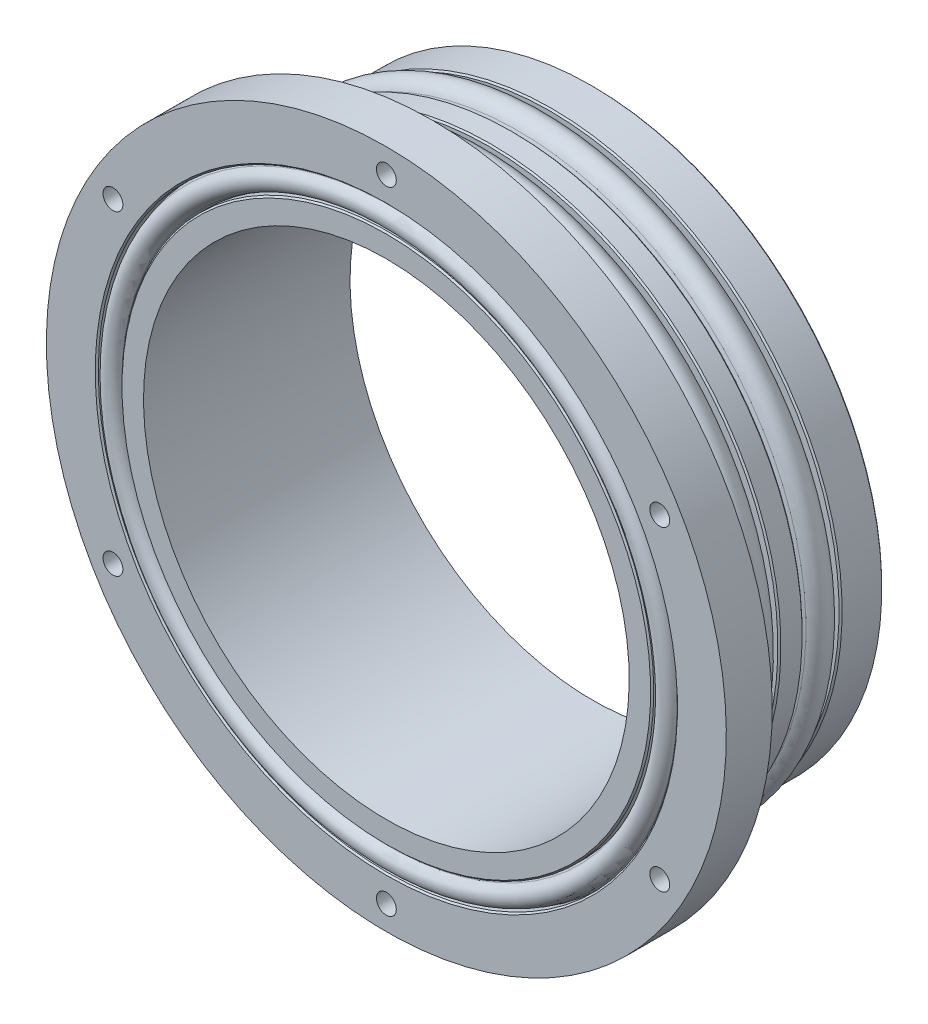
ISO-10303-21;
HEADER;
FILE_DESCRIPTION(('STEP AP214'),'2;1');
FILE_NAME('part.step','',(''),(''),'','','');
FILE_SCHEMA(('AUTOMOTIVE_DESIGN { 1 0 10303 214 1 1 1 1 }'));
ENDSEC;
DATA;
#1=APPLICATION_CONTEXT('core data for automotive mechanical design processes');
#2=APPLICATION_PROTOCOL_DEFINITION('international standard','automotive_design',2000,#1);
#3=PRODUCT_CONTEXT('',#1,'mechanical');
#4=PRODUCT('Part','Part','',(#3));
#5=PRODUCT_RELATED_PRODUCT_CATEGORY('part','',(#4));
#6=PRODUCT_DEFINITION_FORMATION('','',#4);
#7=PRODUCT_DEFINITION_CONTEXT('part definition',#1,'design');
#8=PRODUCT_DEFINITION('design','',#6,#7);
#9=PRODUCT_DEFINITION_SHAPE('','',#8);
#10=(LENGTH_UNIT() NAMED_UNIT(*) SI_UNIT(.MILLI.,.METRE.));
#11=(NAMED_UNIT(*) PLANE_ANGLE_UNIT() SI_UNIT($,.RADIAN.));
#12=(NAMED_UNIT(*) SI_UNIT($,.STERADIAN.) SOLID_ANGLE_UNIT());
#13=UNCERTAINTY_MEASURE_WITH_UNIT(LENGTH_MEASURE(1.E-05),#10,'distance_accuracy_value','');
#14=(GEOMETRIC_REPRESENTATION_CONTEXT(3) GLOBAL_UNCERTAINTY_ASSIGNED_CONTEXT((#13)) GLOBAL_UNIT_ASSIGNED_CONTEXT((#10,
#11,#12)) REPRESENTATION_CONTEXT('',''));
#15=CARTESIAN_POINT('',(0.,0.,0.));
#16=DIRECTION('',(0.,0.,1.));
#17=DIRECTION('',(1.,0.,0.));
#18=AXIS2_PLACEMENT_3D('',#15,#16,#17);
#19=CARTESIAN_POINT('',(0.,31.75,0.));
#20=DIRECTION('',(0.,0.,-1.));
#21=DIRECTION('',(0.,1.,0.));
#22=AXIS2_PLACEMENT_3D('',#19,#20,#21);
#23=PLANE('',#22);
#24=CARTESIAN_POINT('',(0.,-34.29,0.));
#25=DIRECTION('',(0.,0.,-1.));
#26=DIRECTION('',(0.,1.,0.));
#27=AXIS2_PLACEMENT_3D('',#24,#25,#26);
#28=CIRCLE('',#27,1.3);
#29=CARTESIAN_POINT('',(0.,-32.99,0.));
#30=VERTEX_POINT('',#29);
#31=EDGE_CURVE('E168',#30,#30,#28,.T.);
#32=ORIENTED_EDGE('',*,*,#31,.F.);
#33=EDGE_LOOP('',(#32));
#34=FACE_BOUND('',#33,.T.);
#35=CARTESIAN_POINT('',(-34.29,0.,0.));
#36=DIRECTION('',(0.,0.,-1.));
#37=DIRECTION('',(0.,1.,0.));
#38=AXIS2_PLACEMENT_3D('',#35,#36,#37);
#39=CIRCLE('',#38,1.3);
#40=CARTESIAN_POINT('',(-34.29,1.3,0.));
#41=VERTEX_POINT('',#40);
#42=EDGE_CURVE('E162',#41,#41,#39,.T.);
#43=ORIENTED_EDGE('',*,*,#42,.F.);
#44=EDGE_LOOP('',(#43));
#45=FACE_BOUND('',#44,.T.);
#46=CARTESIAN_POINT('',(0.,34.29,0.));
#47=DIRECTION('',(0.,0.,-1.));
#48=DIRECTION('',(0.,1.,0.));
#49=AXIS2_PLACEMENT_3D('',#46,#47,#48);
#50=CIRCLE('',#49,1.3);
#51=CARTESIAN_POINT('',(0.,35.59,0.));
#52=VERTEX_POINT('',#51);
#53=EDGE_CURVE('E156',#52,#52,#50,.T.);
#54=ORIENTED_EDGE('',*,*,#53,.F.);
#55=EDGE_LOOP('',(#54));
#56=FACE_BOUND('',#55,.T.);
#57=CARTESIAN_POINT('',(34.29,0.,0.));
#58=DIRECTION('',(0.,0.,-1.));
#59=DIRECTION('',(0.,1.,0.));
#60=AXIS2_PLACEMENT_3D('',#57,#58,#59);
#61=CIRCLE('',#60,1.3);
#62=CARTESIAN_POINT('',(34.29,1.3,0.));
#63=VERTEX_POINT('',#62);
#64=EDGE_CURVE('E150',#63,#63,#61,.T.);
#65=ORIENTED_EDGE('',*,*,#64,.F.);
#66=EDGE_LOOP('',(#65));
#67=FACE_BOUND('',#66,.T.);
#68=CARTESIAN_POINT('',(0.,0.,0.));
#69=DIRECTION('',(0.,0.,-1.));
#70=DIRECTION('',(0.,1.,0.));
#71=AXIS2_PLACEMENT_3D('',#68,#69,#70);
#72=CIRCLE('',#71,37.773);
#73=CARTESIAN_POINT('',(0.,37.773,0.));
#74=VERTEX_POINT('',#73);
#75=EDGE_CURVE('E83',#74,#74,#72,.T.);
#76=ORIENTED_EDGE('',*,*,#75,.T.);
#77=EDGE_LOOP('',(#76));
#78=FACE_BOUND('',#77,.T.);
#79=CARTESIAN_POINT('',(0.,0.,0.));
#80=DIRECTION('',(0.,0.,-1.));
#81=DIRECTION('',(0.,1.,0.));
#82=AXIS2_PLACEMENT_3D('',#79,#80,#81);
#83=CIRCLE('',#82,31.75);
#84=CARTESIAN_POINT('',(0.,31.75,0.));
#85=VERTEX_POINT('',#84);
#86=EDGE_CURVE('E110',#85,#85,#83,.T.);
#87=ORIENTED_EDGE('',*,*,#86,.F.);
#88=EDGE_LOOP('',(#87));
#89=FACE_BOUND('',#88,.T.);
#90=ADVANCED_FACE('F30',(#34,#45,#56,#67,#78,#89),#23,.T.);
#91=CARTESIAN_POINT('',(0.,0.,0.));
#92=DIRECTION('',(0.,0.,-1.));
#93=DIRECTION('',(0.,1.,0.));
#94=AXIS2_PLACEMENT_3D('',#91,#92,#93);
#95=CYLINDRICAL_SURFACE('',#94,37.973);
#96=CARTESIAN_POINT('',(0.,0.,0.199999999999959));
#97=DIRECTION('',(0.,0.,-1.));
#98=DIRECTION('',(0.,1.,0.));
#99=AXIS2_PLACEMENT_3D('',#96,#97,#98);
#100=CIRCLE('',#99,37.973);
#101=CARTESIAN_POINT('',(0.,37.973,0.199999999999964));
#102=VERTEX_POINT('',#101);
#103=EDGE_CURVE('E77',#102,#102,#100,.F.);
#104=ORIENTED_EDGE('',*,*,#103,.T.);
#105=EDGE_LOOP('',(#104));
#106=FACE_BOUND('',#105,.T.);
#107=CARTESIAN_POINT('',(0.,0.,5.38700000000003));
#108=DIRECTION('',(0.,0.,1.));
#109=DIRECTION('',(0.,-1.,0.));
#110=AXIS2_PLACEMENT_3D('',#107,#108,#109);
#111=CIRCLE('',#110,37.973);
#112=CARTESIAN_POINT('',(0.,-37.973,5.38700000000002));
#113=VERTEX_POINT('',#112);
#114=EDGE_CURVE('E80',#113,#113,#111,.F.);
#115=ORIENTED_EDGE('',*,*,#114,.T.);
#116=EDGE_LOOP('',(#115));
#117=FACE_BOUND('',#116,.T.);
#118=ADVANCED_FACE('F207',(#106,#117),#95,.T.);
#119=CARTESIAN_POINT('',(0.,35.2806,5.587));
#120=DIRECTION('',(0.,0.,1.));
#121=DIRECTION('',(0.,-1.,0.));
#122=AXIS2_PLACEMENT_3D('',#119,#120,#121);
#123=PLANE('',#122);
#124=CARTESIAN_POINT('',(0.,0.,5.587));
#125=DIRECTION('',(0.,0.,1.));
#126=DIRECTION('',(0.,-1.,0.));
#127=AXIS2_PLACEMENT_3D('',#124,#125,#126);
#128=CIRCLE('',#127,36.0426);
#129=CARTESIAN_POINT('',(0.,-36.0426,5.58699999999999));
#130=VERTEX_POINT('',#129);
#131=EDGE_CURVE('E10',#130,#130,#128,.T.);
#132=ORIENTED_EDGE('',*,*,#131,.F.);
#133=EDGE_LOOP('',(#132));
#134=FACE_BOUND('',#133,.T.);
#135=CARTESIAN_POINT('',(0.,0.,5.587));
#136=DIRECTION('',(0.,0.,1.));
#137=DIRECTION('',(0.,-1.,0.));
#138=AXIS2_PLACEMENT_3D('',#135,#136,#137);
#139=CIRCLE('',#138,37.773);
#140=CARTESIAN_POINT('',(0.,-37.773,5.58699999999999));
#141=VERTEX_POINT('',#140);
#142=EDGE_CURVE('E68',#141,#141,#139,.T.);
#143=ORIENTED_EDGE('',*,*,#142,.T.);
#144=EDGE_LOOP('',(#143));
#145=FACE_BOUND('',#144,.T.);
#146=ADVANCED_FACE('F213',(#134,#145),#123,.T.);
#147=CARTESIAN_POINT('',(0.,37.973,10.413));
#148=DIRECTION('',(0.,0.,-1.));
#149=DIRECTION('',(0.,1.,0.));
#150=AXIS2_PLACEMENT_3D('',#147,#148,#149);
#151=PLANE('',#150);
#152=CARTESIAN_POINT('',(0.,0.,10.413));
#153=DIRECTION('',(0.,0.,-1.));
#154=DIRECTION('',(0.,1.,0.));
#155=AXIS2_PLACEMENT_3D('',#152,#153,#154);
#156=CIRCLE('',#155,36.0426);
#157=CARTESIAN_POINT('',(0.,36.0426,10.413));
#158=VERTEX_POINT('',#157);
#159=EDGE_CURVE('E37',#158,#158,#156,.T.);
#160=ORIENTED_EDGE('',*,*,#159,.F.);
#161=EDGE_LOOP('',(#160));
#162=FACE_BOUND('',#161,.T.);
#163=CARTESIAN_POINT('',(0.,0.,10.413));
#164=DIRECTION('',(0.,0.,-1.));
#165=DIRECTION('',(0.,1.,0.));
#166=AXIS2_PLACEMENT_3D('',#163,#164,#165);
#167=CIRCLE('',#166,37.773);
#168=CARTESIAN_POINT('',(0.,37.773,10.413));
#169=VERTEX_POINT('',#168);
#170=EDGE_CURVE('E65',#169,#169,#167,.T.);
#171=ORIENTED_EDGE('',*,*,#170,.T.);
#172=EDGE_LOOP('',(#171));
#173=FACE_BOUND('',#172,.T.);
#174=ADVANCED_FACE('F252',(#162,#173),#151,.T.);
#175=CARTESIAN_POINT('',(0.,0.,0.));
#176=DIRECTION('',(0.,0.,-1.));
#177=DIRECTION('',(0.,1.,0.));
#178=AXIS2_PLACEMENT_3D('',#175,#176,#177);
#179=CYLINDRICAL_SURFACE('',#178,37.973);
#180=CARTESIAN_POINT('',(0.,0.,10.613));
#181=DIRECTION('',(0.,0.,-1.));
#182=DIRECTION('',(0.,1.,0.));
#183=AXIS2_PLACEMENT_3D('',#180,#181,#182);
#184=CIRCLE('',#183,37.973);
#185=CARTESIAN_POINT('',(0.,37.973,10.613));
#186=VERTEX_POINT('',#185);
#187=EDGE_CURVE('E59',#186,#186,#184,.F.);
#188=ORIENTED_EDGE('',*,*,#187,.T.);
#189=EDGE_LOOP('',(#188));
#190=FACE_BOUND('',#189,.T.);
#191=CARTESIAN_POINT('',(0.,0.,13.387));
#192=DIRECTION('',(0.,0.,1.));
#193=DIRECTION('',(0.,-1.,0.));
#194=AXIS2_PLACEMENT_3D('',#191,#192,#193);
#195=CIRCLE('',#194,37.973);
#196=CARTESIAN_POINT('',(0.,-37.973,13.387));
#197=VERTEX_POINT('',#196);
#198=EDGE_CURVE('E62',#197,#197,#195,.F.);
#199=ORIENTED_EDGE('',*,*,#198,.T.);
#200=EDGE_LOOP('',(#199));
#201=FACE_BOUND('',#200,.T.);
#202=ADVANCED_FACE('F254',(#190,#201),#179,.T.);
#203=CARTESIAN_POINT('',(0.,35.2806,13.587));
#204=DIRECTION('',(0.,0.,1.));
#205=DIRECTION('',(0.,-1.,0.));
#206=AXIS2_PLACEMENT_3D('',#203,#204,#205);
#207=PLANE('',#206);
#208=CARTESIAN_POINT('',(0.,0.,13.587));
#209=DIRECTION('',(0.,0.,1.));
#210=DIRECTION('',(0.,-1.,0.));
#211=AXIS2_PLACEMENT_3D('',#208,#209,#210);
#212=CIRCLE('',#211,36.0426);
#213=CARTESIAN_POINT('',(0.,-36.0426,13.587));
#214=VERTEX_POINT('',#213);
#215=EDGE_CURVE('E50',#214,#214,#212,.T.);
#216=ORIENTED_EDGE('',*,*,#215,.F.);
#217=EDGE_LOOP('',(#216));
#218=FACE_BOUND('',#217,.T.);
#219=CARTESIAN_POINT('',(0.,0.,13.587));
#220=DIRECTION('',(0.,0.,1.));
#221=DIRECTION('',(0.,-1.,0.));
#222=AXIS2_PLACEMENT_3D('',#219,#220,#221);
#223=CIRCLE('',#222,37.773);
#224=CARTESIAN_POINT('',(0.,-37.773,13.587));
#225=VERTEX_POINT('',#224);
#226=EDGE_CURVE('E56',#225,#225,#223,.T.);
#227=ORIENTED_EDGE('',*,*,#226,.T.);
#228=EDGE_LOOP('',(#227));
#229=FACE_BOUND('',#228,.T.);
#230=ADVANCED_FACE('F261',(#218,#229),#207,.T.);
#231=CARTESIAN_POINT('',(0.,37.973,18.413));
#232=DIRECTION('',(0.,0.,-1.));
#233=DIRECTION('',(0.,1.,0.));
#234=AXIS2_PLACEMENT_3D('',#231,#232,#233);
#235=PLANE('',#234);
#236=CARTESIAN_POINT('',(0.,0.,18.413));
#237=DIRECTION('',(0.,0.,-1.));
#238=DIRECTION('',(0.,1.,0.));
#239=AXIS2_PLACEMENT_3D('',#236,#237,#238);
#240=CIRCLE('',#239,36.0426);
#241=CARTESIAN_POINT('',(0.,36.0426,18.413));
#242=VERTEX_POINT('',#241);
#243=EDGE_CURVE('E53',#242,#242,#240,.T.);
#244=ORIENTED_EDGE('',*,*,#243,.F.);
#245=EDGE_LOOP('',(#244));
#246=FACE_BOUND('',#245,.T.);
#247=CARTESIAN_POINT('',(0.,0.,18.413));
#248=DIRECTION('',(0.,0.,-1.));
#249=DIRECTION('',(0.,1.,0.));
#250=AXIS2_PLACEMENT_3D('',#247,#248,#249);
#251=CIRCLE('',#250,37.773);
#252=CARTESIAN_POINT('',(0.,37.773,18.413));
#253=VERTEX_POINT('',#252);
#254=EDGE_CURVE('E74',#253,#253,#251,.T.);
#255=ORIENTED_EDGE('',*,*,#254,.T.);
#256=EDGE_LOOP('',(#255));
#257=FACE_BOUND('',#256,.T.);
#258=ADVANCED_FACE('F268',(#246,#257),#235,.T.);
#259=CARTESIAN_POINT('',(0.,0.,0.));
#260=DIRECTION('',(0.,0.,-1.));
#261=DIRECTION('',(0.,1.,0.));
#262=AXIS2_PLACEMENT_3D('',#259,#260,#261);
#263=CYLINDRICAL_SURFACE('',#262,37.973);
#264=CARTESIAN_POINT('',(0.,0.,18.613));
#265=DIRECTION('',(0.,0.,-1.));
#266=DIRECTION('',(0.,1.,0.));
#267=AXIS2_PLACEMENT_3D('',#264,#265,#266);
#268=CIRCLE('',#267,37.973);
#269=CARTESIAN_POINT('',(0.,37.973,18.613));
#270=VERTEX_POINT('',#269);
#271=EDGE_CURVE('E71',#270,#270,#268,.F.);
#272=ORIENTED_EDGE('',*,*,#271,.T.);
#273=EDGE_LOOP('',(#272));
#274=FACE_BOUND('',#273,.T.);
#275=CARTESIAN_POINT('',(0.,0.,21.));
#276=DIRECTION('',(0.,0.,-1.));
#277=DIRECTION('',(0.,1.,0.));
#278=AXIS2_PLACEMENT_3D('',#275,#276,#277);
#279=CIRCLE('',#278,37.973);
#280=CARTESIAN_POINT('',(0.,37.973,21.));
#281=VERTEX_POINT('',#280);
#282=EDGE_CURVE('E98',#281,#281,#279,.T.);
#283=ORIENTED_EDGE('',*,*,#282,.T.);
#284=EDGE_LOOP('',(#283));
#285=FACE_BOUND('',#284,.T.);
#286=ADVANCED_FACE('F272',(#274,#285),#263,.T.);
#287=CARTESIAN_POINT('',(0.,37.973,21.));
#288=DIRECTION('',(0.,0.,-1.));
#289=DIRECTION('',(0.,1.,0.));
#290=AXIS2_PLACEMENT_3D('',#287,#288,#289);
#291=PLANE('',#290);
#292=CARTESIAN_POINT('',(-35.7451985412027,20.6375,21.));
#293=DIRECTION('',(0.,0.,-1.));
#294=DIRECTION('',(0.,1.,0.));
#295=AXIS2_PLACEMENT_3D('',#292,#293,#294);
#296=CIRCLE('',#295,1.3);
#297=CARTESIAN_POINT('',(-35.7451985412027,21.9375,21.));
#298=VERTEX_POINT('',#297);
#299=EDGE_CURVE('E143',#298,#298,#296,.F.);
#300=ORIENTED_EDGE('',*,*,#299,.T.);
#301=EDGE_LOOP('',(#300));
#302=FACE_BOUND('',#301,.T.);
#303=CARTESIAN_POINT('',(-35.7451985412027,-20.6375,21.));
#304=DIRECTION('',(0.,0.,-1.));
#305=DIRECTION('',(0.,1.,0.));
#306=AXIS2_PLACEMENT_3D('',#303,#304,#305);
#307=CIRCLE('',#306,1.3);
#308=CARTESIAN_POINT('',(-35.7451985412027,-19.3375,21.));
#309=VERTEX_POINT('',#308);
#310=EDGE_CURVE('E137',#309,#309,#307,.F.);
#311=ORIENTED_EDGE('',*,*,#310,.T.);
#312=EDGE_LOOP('',(#311));
#313=FACE_BOUND('',#312,.T.);
#314=CARTESIAN_POINT('',(0.,-41.275,21.));
#315=DIRECTION('',(0.,0.,-1.));
#316=DIRECTION('',(0.,1.,0.));
#317=AXIS2_PLACEMENT_3D('',#314,#315,#316);
#318=CIRCLE('',#317,1.3);
#319=CARTESIAN_POINT('',(0.,-39.975,21.));
#320=VERTEX_POINT('',#319);
#321=EDGE_CURVE('E131',#320,#320,#318,.F.);
#322=ORIENTED_EDGE('',*,*,#321,.T.);
#323=EDGE_LOOP('',(#322));
#324=FACE_BOUND('',#323,.T.);
#325=CARTESIAN_POINT('',(35.7451985412027,-20.6375,21.));
#326=DIRECTION('',(0.,0.,-1.));
#327=DIRECTION('',(0.,1.,0.));
#328=AXIS2_PLACEMENT_3D('',#325,#326,#327);
#329=CIRCLE('',#328,1.3);
#330=CARTESIAN_POINT('',(35.7451985412027,-19.3375,21.));
#331=VERTEX_POINT('',#330);
#332=EDGE_CURVE('E125',#331,#331,#329,.F.);
#333=ORIENTED_EDGE('',*,*,#332,.T.);
#334=EDGE_LOOP('',(#333));
#335=FACE_BOUND('',#334,.T.);
#336=CARTESIAN_POINT('',(35.7451985412027,20.6375,21.));
#337=DIRECTION('',(0.,0.,-1.));
#338=DIRECTION('',(0.,1.,0.));
#339=AXIS2_PLACEMENT_3D('',#336,#337,#338);
#340=CIRCLE('',#339,1.3);
#341=CARTESIAN_POINT('',(35.7451985412027,21.9375,21.));
#342=VERTEX_POINT('',#341);
#343=EDGE_CURVE('E119',#342,#342,#340,.F.);
#344=ORIENTED_EDGE('',*,*,#343,.T.);
#345=EDGE_LOOP('',(#344));
#346=FACE_BOUND('',#345,.T.);
#347=CARTESIAN_POINT('',(0.,41.275,21.));
#348=DIRECTION('',(0.,0.,-1.));
#349=DIRECTION('',(0.,1.,0.));
#350=AXIS2_PLACEMENT_3D('',#347,#348,#349);
#351=CIRCLE('',#350,1.3);
#352=CARTESIAN_POINT('',(0.,42.575,21.));
#353=VERTEX_POINT('',#352);
#354=EDGE_CURVE('E113',#353,#353,#351,.F.);
#355=ORIENTED_EDGE('',*,*,#354,.T.);
#356=EDGE_LOOP('',(#355));
#357=FACE_BOUND('',#356,.T.);
#358=CARTESIAN_POINT('',(0.,0.,21.));
#359=DIRECTION('',(0.,0.,-1.));
#360=DIRECTION('',(0.,1.,0.));
#361=AXIS2_PLACEMENT_3D('',#358,#359,#360);
#362=CIRCLE('',#361,44.45);
#363=CARTESIAN_POINT('',(0.,44.45,21.));
#364=VERTEX_POINT('',#363);
#365=EDGE_CURVE('E101',#364,#364,#362,.T.);
#366=ORIENTED_EDGE('',*,*,#365,.T.);
#367=EDGE_LOOP('',(#366));
#368=FACE_BOUND('',#367,.T.);
#369=ORIENTED_EDGE('',*,*,#282,.F.);
#370=EDGE_LOOP('',(#369));
#371=FACE_BOUND('',#370,.T.);
#372=ADVANCED_FACE('F276',(#302,#313,#324,#335,#346,#357,#368,#371),#291,.T.);
#373=CARTESIAN_POINT('',(0.,0.,0.));
#374=DIRECTION('',(0.,0.,-1.));
#375=DIRECTION('',(0.,1.,0.));
#376=AXIS2_PLACEMENT_3D('',#373,#374,#375);
#377=CYLINDRICAL_SURFACE('',#376,44.45);
#378=CARTESIAN_POINT('',(0.,0.,27.));
#379=DIRECTION('',(0.,0.,-1.));
#380=DIRECTION('',(0.,1.,0.));
#381=AXIS2_PLACEMENT_3D('',#378,#379,#380);
#382=CIRCLE('',#381,44.45);
#383=CARTESIAN_POINT('',(0.,44.45,27.));
#384=VERTEX_POINT('',#383);
#385=EDGE_CURVE('E104',#384,#384,#382,.T.);
#386=ORIENTED_EDGE('',*,*,#385,.T.);
#387=EDGE_LOOP('',(#386));
#388=FACE_BOUND('',#387,.T.);
#389=ORIENTED_EDGE('',*,*,#365,.F.);
#390=EDGE_LOOP('',(#389));
#391=FACE_BOUND('',#390,.T.);
#392=ADVANCED_FACE('F280',(#388,#391),#377,.T.);
#393=CARTESIAN_POINT('',(0.,44.45,27.));
#394=DIRECTION('',(0.,0.,1.));
#395=DIRECTION('',(0.,-1.,0.));
#396=AXIS2_PLACEMENT_3D('',#393,#394,#395);
#397=PLANE('',#396);
#398=CARTESIAN_POINT('',(0.,0.,27.));
#399=DIRECTION('',(0.,0.,1.));
#400=DIRECTION('',(0.,-1.,0.));
#401=AXIS2_PLACEMENT_3D('',#398,#399,#400);
#402=CIRCLE('',#401,38.0587);
#403=CARTESIAN_POINT('',(0.,-38.0587,27.));
#404=VERTEX_POINT('',#403);
#405=EDGE_CURVE('E95',#404,#404,#402,.F.);
#406=ORIENTED_EDGE('',*,*,#405,.T.);
#407=EDGE_LOOP('',(#406));
#408=FACE_BOUND('',#407,.T.);
#409=CARTESIAN_POINT('',(-35.7451985412027,20.6375,27.));
#410=DIRECTION('',(0.,0.,1.));
#411=DIRECTION('',(1.,0.,0.));
#412=AXIS2_PLACEMENT_3D('',#409,#410,#411);
#413=CIRCLE('',#412,1.3);
#414=CARTESIAN_POINT('',(-34.4451985412027,20.6375,27.));
#415=VERTEX_POINT('',#414);
#416=EDGE_CURVE('E146',#415,#415,#413,.T.);
#417=ORIENTED_EDGE('',*,*,#416,.F.);
#418=EDGE_LOOP('',(#417));
#419=FACE_BOUND('',#418,.T.);
#420=CARTESIAN_POINT('',(-35.7451985412027,-20.6375,27.));
#421=DIRECTION('',(0.,0.,1.));
#422=DIRECTION('',(1.,0.,0.));
#423=AXIS2_PLACEMENT_3D('',#420,#421,#422);
#424=CIRCLE('',#423,1.3);
#425=CARTESIAN_POINT('',(-34.4451985412027,-20.6375,27.));
#426=VERTEX_POINT('',#425);
#427=EDGE_CURVE('E140',#426,#426,#424,.T.);
#428=ORIENTED_EDGE('',*,*,#427,.F.);
#429=EDGE_LOOP('',(#428));
#430=FACE_BOUND('',#429,.T.);
#431=CARTESIAN_POINT('',(0.,-41.275,27.));
#432=DIRECTION('',(0.,0.,1.));
#433=DIRECTION('',(1.,0.,0.));
#434=AXIS2_PLACEMENT_3D('',#431,#432,#433);
#435=CIRCLE('',#434,1.3);
#436=CARTESIAN_POINT('',(1.30000000000001,-41.275,27.));
#437=VERTEX_POINT('',#436);
#438=EDGE_CURVE('E134',#437,#437,#435,.T.);
#439=ORIENTED_EDGE('',*,*,#438,.F.);
#440=EDGE_LOOP('',(#439));
#441=FACE_BOUND('',#440,.T.);
#442=CARTESIAN_POINT('',(35.7451985412027,-20.6375,27.));
#443=DIRECTION('',(0.,0.,1.));
#444=DIRECTION('',(1.,0.,0.));
#445=AXIS2_PLACEMENT_3D('',#442,#443,#444);
#446=CIRCLE('',#445,1.3);
#447=CARTESIAN_POINT('',(37.0451985412027,-20.6375,27.));
#448=VERTEX_POINT('',#447);
#449=EDGE_CURVE('E128',#448,#448,#446,.T.);
#450=ORIENTED_EDGE('',*,*,#449,.F.);
#451=EDGE_LOOP('',(#450));
#452=FACE_BOUND('',#451,.T.);
#453=CARTESIAN_POINT('',(35.7451985412027,20.6375,27.));
#454=DIRECTION('',(0.,0.,1.));
#455=DIRECTION('',(1.,0.,0.));
#456=AXIS2_PLACEMENT_3D('',#453,#454,#455);
#457=CIRCLE('',#456,1.3);
#458=CARTESIAN_POINT('',(37.0451985412027,20.6375,27.));
#459=VERTEX_POINT('',#458);
#460=EDGE_CURVE('E122',#459,#459,#457,.T.);
#461=ORIENTED_EDGE('',*,*,#460,.F.);
#462=EDGE_LOOP('',(#461));
#463=FACE_BOUND('',#462,.T.);
#464=CARTESIAN_POINT('',(0.,41.275,27.));
#465=DIRECTION('',(0.,0.,1.));
#466=DIRECTION('',(1.,0.,0.));
#467=AXIS2_PLACEMENT_3D('',#464,#465,#466);
#468=CIRCLE('',#467,1.3);
#469=CARTESIAN_POINT('',(1.3,41.275,27.));
#470=VERTEX_POINT('',#469);
#471=EDGE_CURVE('E116',#470,#470,#468,.T.);
#472=ORIENTED_EDGE('',*,*,#471,.F.);
#473=EDGE_LOOP('',(#472));
#474=FACE_BOUND('',#473,.T.);
#475=ORIENTED_EDGE('',*,*,#385,.F.);
#476=EDGE_LOOP('',(#475));
#477=FACE_BOUND('',#476,.T.);
#478=ADVANCED_FACE('F284',(#408,#419,#430,#441,#452,#463,#474,#477),#397,.T.);
#479=CARTESIAN_POINT('',(0.,0.,0.));
#480=DIRECTION('',(0.,0.,-1.));
#481=DIRECTION('',(0.,1.,0.));
#482=AXIS2_PLACEMENT_3D('',#479,#480,#481);
#483=CYLINDRICAL_SURFACE('',#482,37.8587);
#484=CARTESIAN_POINT('',(0.,0.,25.8061578635827));
#485=DIRECTION('',(0.,0.,-1.));
#486=DIRECTION('',(-1.,0.,0.));
#487=AXIS2_PLACEMENT_3D('',#484,#485,#486);
#488=CIRCLE('',#487,37.8587);
#489=CARTESIAN_POINT('',(-37.8587,0.,25.8061578635827));
#490=VERTEX_POINT('',#489);
#491=EDGE_CURVE('E41',#490,#490,#488,.F.);
#492=ORIENTED_EDGE('',*,*,#491,.F.);
#493=EDGE_LOOP('',(#492));
#494=FACE_BOUND('',#493,.T.);
#495=CARTESIAN_POINT('',(0.,0.,26.8));
#496=DIRECTION('',(0.,0.,1.));
#497=DIRECTION('',(0.,-1.,0.));
#498=AXIS2_PLACEMENT_3D('',#495,#496,#497);
#499=CIRCLE('',#498,37.8587);
#500=CARTESIAN_POINT('',(0.,-37.8587,26.8));
#501=VERTEX_POINT('',#500);
#502=EDGE_CURVE('E92',#501,#501,#499,.T.);
#503=ORIENTED_EDGE('',*,*,#502,.T.);
#504=EDGE_LOOP('',(#503));
#505=FACE_BOUND('',#504,.T.);
#506=ADVANCED_FACE('F288',(#494,#505),#483,.F.);
#507=CARTESIAN_POINT('',(0.,0.,0.));
#508=DIRECTION('',(0.,0.,-1.));
#509=DIRECTION('',(0.,1.,0.));
#510=AXIS2_PLACEMENT_3D('',#507,#508,#509);
#511=CYLINDRICAL_SURFACE('',#510,34.7599);
#512=CARTESIAN_POINT('',(0.,0.,25.821791671619));
#513=DIRECTION('',(0.,0.,1.));
#514=DIRECTION('',(1.,0.,0.));
#515=AXIS2_PLACEMENT_3D('',#512,#513,#514);
#516=CIRCLE('',#515,34.7599);
#517=CARTESIAN_POINT('',(34.7599,0.,25.821791671619));
#518=VERTEX_POINT('',#517);
#519=EDGE_CURVE('E45',#518,#518,#516,.F.);
#520=ORIENTED_EDGE('',*,*,#519,.F.);
#521=EDGE_LOOP('',(#520));
#522=FACE_BOUND('',#521,.T.);
#523=CARTESIAN_POINT('',(0.,0.,26.8));
#524=DIRECTION('',(0.,0.,1.));
#525=DIRECTION('',(0.,-1.,0.));
#526=AXIS2_PLACEMENT_3D('',#523,#524,#525);
#527=CIRCLE('',#526,34.7599);
#528=CARTESIAN_POINT('',(0.,-34.7599,26.8));
#529=VERTEX_POINT('',#528);
#530=EDGE_CURVE('E89',#529,#529,#527,.F.);
#531=ORIENTED_EDGE('',*,*,#530,.T.);
#532=EDGE_LOOP('',(#531));
#533=FACE_BOUND('',#532,.T.);
#534=ADVANCED_FACE('F292',(#522,#533),#511,.T.);
#535=CARTESIAN_POINT('',(0.,34.7599,27.));
#536=DIRECTION('',(0.,0.,1.));
#537=DIRECTION('',(0.,-1.,0.));
#538=AXIS2_PLACEMENT_3D('',#535,#536,#537);
#539=PLANE('',#538);
#540=CARTESIAN_POINT('',(0.,0.,27.));
#541=DIRECTION('',(0.,0.,1.));
#542=DIRECTION('',(0.,-1.,0.));
#543=AXIS2_PLACEMENT_3D('',#540,#541,#542);
#544=CIRCLE('',#543,34.5599);
#545=CARTESIAN_POINT('',(0.,-34.5599,27.));
#546=VERTEX_POINT('',#545);
#547=EDGE_CURVE('E86',#546,#546,#544,.T.);
#548=ORIENTED_EDGE('',*,*,#547,.T.);
#549=EDGE_LOOP('',(#548));
#550=FACE_BOUND('',#549,.T.);
#551=CARTESIAN_POINT('',(0.,0.,27.));
#552=DIRECTION('',(0.,0.,-1.));
#553=DIRECTION('',(0.,1.,0.));
#554=AXIS2_PLACEMENT_3D('',#551,#552,#553);
#555=CIRCLE('',#554,31.75);
#556=CARTESIAN_POINT('',(0.,31.75,27.));
#557=VERTEX_POINT('',#556);
#558=EDGE_CURVE('E107',#557,#557,#555,.T.);
#559=ORIENTED_EDGE('',*,*,#558,.T.);
#560=EDGE_LOOP('',(#559));
#561=FACE_BOUND('',#560,.T.);
#562=ADVANCED_FACE('F296',(#550,#561),#539,.T.);
#563=CARTESIAN_POINT('',(0.,0.,0.));
#564=DIRECTION('',(0.,0.,-1.));
#565=DIRECTION('',(0.,1.,0.));
#566=AXIS2_PLACEMENT_3D('',#563,#564,#565);
#567=CYLINDRICAL_SURFACE('',#566,31.75);
#568=ORIENTED_EDGE('',*,*,#86,.T.);
#569=EDGE_LOOP('',(#568));
#570=FACE_BOUND('',#569,.T.);
#571=ORIENTED_EDGE('',*,*,#558,.F.);
#572=EDGE_LOOP('',(#571));
#573=FACE_BOUND('',#572,.T.);
#574=ADVANCED_FACE('F300',(#570,#573),#567,.F.);
#575=CARTESIAN_POINT('',(0.,41.275,17.3230447378299));
#576=DIRECTION('',(0.,0.,1.));
#577=DIRECTION('',(1.,0.,0.));
#578=AXIS2_PLACEMENT_3D('',#575,#576,#577);
#579=CYLINDRICAL_SURFACE('',#578,1.3);
#580=ORIENTED_EDGE('',*,*,#471,.T.);
#581=EDGE_LOOP('',(#580));
#582=FACE_BOUND('',#581,.T.);
#583=ORIENTED_EDGE('',*,*,#354,.F.);
#584=EDGE_LOOP('',(#583));
#585=FACE_BOUND('',#584,.T.);
#586=ADVANCED_FACE('F304',(#582,#585),#579,.F.);
#587=CARTESIAN_POINT('',(35.7451985412027,20.6375,17.3230447378299));
#588=DIRECTION('',(0.,0.,1.));
#589=DIRECTION('',(1.,0.,0.));
#590=AXIS2_PLACEMENT_3D('',#587,#588,#589);
#591=CYLINDRICAL_SURFACE('',#590,1.3);
#592=ORIENTED_EDGE('',*,*,#460,.T.);
#593=EDGE_LOOP('',(#592));
#594=FACE_BOUND('',#593,.T.);
#595=ORIENTED_EDGE('',*,*,#343,.F.);
#596=EDGE_LOOP('',(#595));
#597=FACE_BOUND('',#596,.T.);
#598=ADVANCED_FACE('F308',(#594,#597),#591,.F.);
#599=CARTESIAN_POINT('',(35.7451985412027,-20.6375,17.3230447378299));
#600=DIRECTION('',(0.,0.,1.));
#601=DIRECTION('',(1.,0.,0.));
#602=AXIS2_PLACEMENT_3D('',#599,#600,#601);
#603=CYLINDRICAL_SURFACE('',#602,1.3);
#604=ORIENTED_EDGE('',*,*,#449,.T.);
#605=EDGE_LOOP('',(#604));
#606=FACE_BOUND('',#605,.T.);
#607=ORIENTED_EDGE('',*,*,#332,.F.);
#608=EDGE_LOOP('',(#607));
#609=FACE_BOUND('',#608,.T.);
#610=ADVANCED_FACE('F312',(#606,#609),#603,.F.);
#611=CARTESIAN_POINT('',(0.,-41.275,17.3230447378299));
#612=DIRECTION('',(0.,0.,1.));
#613=DIRECTION('',(1.,0.,0.));
#614=AXIS2_PLACEMENT_3D('',#611,#612,#613);
#615=CYLINDRICAL_SURFACE('',#614,1.3);
#616=ORIENTED_EDGE('',*,*,#438,.T.);
#617=EDGE_LOOP('',(#616));
#618=FACE_BOUND('',#617,.T.);
#619=ORIENTED_EDGE('',*,*,#321,.F.);
#620=EDGE_LOOP('',(#619));
#621=FACE_BOUND('',#620,.T.);
#622=ADVANCED_FACE('F316',(#618,#621),#615,.F.);
#623=CARTESIAN_POINT('',(-35.7451985412027,-20.6375,17.3230447378299));
#624=DIRECTION('',(0.,0.,1.));
#625=DIRECTION('',(1.,0.,0.));
#626=AXIS2_PLACEMENT_3D('',#623,#624,#625);
#627=CYLINDRICAL_SURFACE('',#626,1.3);
#628=ORIENTED_EDGE('',*,*,#427,.T.);
#629=EDGE_LOOP('',(#628));
#630=FACE_BOUND('',#629,.T.);
#631=ORIENTED_EDGE('',*,*,#310,.F.);
#632=EDGE_LOOP('',(#631));
#633=FACE_BOUND('',#632,.T.);
#634=ADVANCED_FACE('F320',(#630,#633),#627,.F.);
#635=CARTESIAN_POINT('',(-35.7451985412027,20.6375,17.3230447378299));
#636=DIRECTION('',(0.,0.,1.));
#637=DIRECTION('',(1.,0.,0.));
#638=AXIS2_PLACEMENT_3D('',#635,#636,#637);
#639=CYLINDRICAL_SURFACE('',#638,1.3);
#640=ORIENTED_EDGE('',*,*,#416,.T.);
#641=EDGE_LOOP('',(#640));
#642=FACE_BOUND('',#641,.T.);
#643=ORIENTED_EDGE('',*,*,#299,.F.);
#644=EDGE_LOOP('',(#643));
#645=FACE_BOUND('',#644,.T.);
#646=ADVANCED_FACE('F224',(#642,#645),#639,.F.);
#647=CARTESIAN_POINT('',(0.,0.,27.));
#648=DIRECTION('',(0.,0.,1.));
#649=DIRECTION('',(0.,-1.,0.));
#650=AXIS2_PLACEMENT_3D('',#647,#648,#649);
#651=CONICAL_SURFACE('',#650,38.0587,0.785398163397431);
#652=ORIENTED_EDGE('',*,*,#502,.F.);
#653=EDGE_LOOP('',(#652));
#654=FACE_BOUND('',#653,.T.);
#655=ORIENTED_EDGE('',*,*,#405,.F.);
#656=EDGE_LOOP('',(#655));
#657=FACE_BOUND('',#656,.T.);
#658=ADVANCED_FACE('F220',(#654,#657),#651,.F.);
#659=CARTESIAN_POINT('',(0.,0.,26.8));
#660=DIRECTION('',(0.,0.,-1.));
#661=DIRECTION('',(0.,1.,0.));
#662=AXIS2_PLACEMENT_3D('',#659,#660,#661);
#663=CONICAL_SURFACE('',#662,34.7599,0.785398163397431);
#664=ORIENTED_EDGE('',*,*,#547,.F.);
#665=EDGE_LOOP('',(#664));
#666=FACE_BOUND('',#665,.T.);
#667=ORIENTED_EDGE('',*,*,#530,.F.);
#668=EDGE_LOOP('',(#667));
#669=FACE_BOUND('',#668,.T.);
#670=ADVANCED_FACE('F223',(#666,#669),#663,.T.);
#671=CARTESIAN_POINT('',(0.,0.,0.));
#672=DIRECTION('',(0.,0.,1.));
#673=DIRECTION('',(0.,-1.,0.));
#674=AXIS2_PLACEMENT_3D('',#671,#672,#673);
#675=CONICAL_SURFACE('',#674,37.773,0.785398163397431);
#676=ORIENTED_EDGE('',*,*,#103,.F.);
#677=EDGE_LOOP('',(#676));
#678=FACE_BOUND('',#677,.T.);
#679=ORIENTED_EDGE('',*,*,#75,.F.);
#680=EDGE_LOOP('',(#679));
#681=FACE_BOUND('',#680,.T.);
#682=ADVANCED_FACE('F228',(#678,#681),#675,.T.);
#683=CARTESIAN_POINT('',(0.,0.,18.413));
#684=DIRECTION('',(0.,0.,1.));
#685=DIRECTION('',(0.,-1.,0.));
#686=AXIS2_PLACEMENT_3D('',#683,#684,#685);
#687=CONICAL_SURFACE('',#686,37.773,0.785398163397431);
#688=ORIENTED_EDGE('',*,*,#271,.F.);
#689=EDGE_LOOP('',(#688));
#690=FACE_BOUND('',#689,.T.);
#691=ORIENTED_EDGE('',*,*,#254,.F.);
#692=EDGE_LOOP('',(#691));
#693=FACE_BOUND('',#692,.T.);
#694=ADVANCED_FACE('F232',(#690,#693),#687,.T.);
#695=CARTESIAN_POINT('',(0.,0.,5.38700000000003));
#696=DIRECTION('',(0.,0.,-1.));
#697=DIRECTION('',(0.,1.,0.));
#698=AXIS2_PLACEMENT_3D('',#695,#696,#697);
#699=CONICAL_SURFACE('',#698,37.973,0.785398163397431);
#700=ORIENTED_EDGE('',*,*,#142,.F.);
#701=EDGE_LOOP('',(#700));
#702=FACE_BOUND('',#701,.T.);
#703=ORIENTED_EDGE('',*,*,#114,.F.);
#704=EDGE_LOOP('',(#703));
#705=FACE_BOUND('',#704,.T.);
#706=ADVANCED_FACE('F236',(#702,#705),#699,.T.);
#707=CARTESIAN_POINT('',(0.,0.,10.413));
#708=DIRECTION('',(0.,0.,1.));
#709=DIRECTION('',(0.,-1.,0.));
#710=AXIS2_PLACEMENT_3D('',#707,#708,#709);
#711=CONICAL_SURFACE('',#710,37.773,0.785398163397431);
#712=ORIENTED_EDGE('',*,*,#187,.F.);
#713=EDGE_LOOP('',(#712));
#714=FACE_BOUND('',#713,.T.);
#715=ORIENTED_EDGE('',*,*,#170,.F.);
#716=EDGE_LOOP('',(#715));
#717=FACE_BOUND('',#716,.T.);
#718=ADVANCED_FACE('F239',(#714,#717),#711,.T.);
#719=CARTESIAN_POINT('',(0.,0.,13.387));
#720=DIRECTION('',(0.,0.,-1.));
#721=DIRECTION('',(0.,1.,0.));
#722=AXIS2_PLACEMENT_3D('',#719,#720,#721);
#723=CONICAL_SURFACE('',#722,37.973,0.785398163397466);
#724=ORIENTED_EDGE('',*,*,#226,.F.);
#725=EDGE_LOOP('',(#724));
#726=FACE_BOUND('',#725,.T.);
#727=ORIENTED_EDGE('',*,*,#198,.F.);
#728=EDGE_LOOP('',(#727));
#729=FACE_BOUND('',#728,.T.);
#730=ADVANCED_FACE('F32',(#726,#729),#723,.T.);
#731=CARTESIAN_POINT('',(34.29,0.,4.));
#732=DIRECTION('',(0.,0.,-1.));
#733=DIRECTION('',(0.,1.,0.));
#734=AXIS2_PLACEMENT_3D('',#731,#732,#733);
#735=CYLINDRICAL_SURFACE('',#734,1.3);
#736=CARTESIAN_POINT('',(34.29,0.,4.));
#737=DIRECTION('',(0.,0.,-1.));
#738=DIRECTION('',(0.,1.,0.));
#739=AXIS2_PLACEMENT_3D('',#736,#737,#738);
#740=CIRCLE('',#739,1.3);
#741=CARTESIAN_POINT('',(34.29,1.3,4.));
#742=VERTEX_POINT('',#741);
#743=EDGE_CURVE('E149',#742,#742,#740,.T.);
#744=ORIENTED_EDGE('',*,*,#743,.F.);
#745=EDGE_LOOP('',(#744));
#746=FACE_BOUND('',#745,.T.);
#747=ORIENTED_EDGE('',*,*,#64,.T.);
#748=EDGE_LOOP('',(#747));
#749=FACE_BOUND('',#748,.T.);
#750=ADVANCED_FACE('F246',(#746,#749),#735,.F.);
#751=CARTESIAN_POINT('',(34.29,0.,4.));
#752=DIRECTION('',(0.,0.,-1.));
#753=DIRECTION('',(0.,1.,0.));
#754=AXIS2_PLACEMENT_3D('',#751,#752,#753);
#755=PLANE('',#754);
#756=ORIENTED_EDGE('',*,*,#743,.T.);
#757=EDGE_LOOP('',(#756));
#758=FACE_BOUND('',#757,.T.);
#759=ADVANCED_FACE('F330',(#758),#755,.T.);
#760=CARTESIAN_POINT('',(0.,34.29,4.));
#761=DIRECTION('',(0.,0.,-1.));
#762=DIRECTION('',(0.,1.,0.));
#763=AXIS2_PLACEMENT_3D('',#760,#761,#762);
#764=CYLINDRICAL_SURFACE('',#763,1.3);
#765=CARTESIAN_POINT('',(0.,34.29,4.));
#766=DIRECTION('',(0.,0.,-1.));
#767=DIRECTION('',(0.,1.,0.));
#768=AXIS2_PLACEMENT_3D('',#765,#766,#767);
#769=CIRCLE('',#768,1.3);
#770=CARTESIAN_POINT('',(0.,35.59,4.));
#771=VERTEX_POINT('',#770);
#772=EDGE_CURVE('E153',#771,#771,#769,.T.);
#773=ORIENTED_EDGE('',*,*,#772,.F.);
#774=EDGE_LOOP('',(#773));
#775=FACE_BOUND('',#774,.T.);
#776=ORIENTED_EDGE('',*,*,#53,.T.);
#777=EDGE_LOOP('',(#776));
#778=FACE_BOUND('',#777,.T.);
#779=ADVANCED_FACE('F334',(#775,#778),#764,.F.);
#780=CARTESIAN_POINT('',(0.,34.29,4.));
#781=DIRECTION('',(0.,0.,-1.));
#782=DIRECTION('',(0.,1.,0.));
#783=AXIS2_PLACEMENT_3D('',#780,#781,#782);
#784=PLANE('',#783);
#785=ORIENTED_EDGE('',*,*,#772,.T.);
#786=EDGE_LOOP('',(#785));
#787=FACE_BOUND('',#786,.T.);
#788=ADVANCED_FACE('F338',(#787),#784,.T.);
#789=CARTESIAN_POINT('',(-34.29,0.,4.));
#790=DIRECTION('',(0.,0.,-1.));
#791=DIRECTION('',(0.,1.,0.));
#792=AXIS2_PLACEMENT_3D('',#789,#790,#791);
#793=CYLINDRICAL_SURFACE('',#792,1.3);
#794=CARTESIAN_POINT('',(-34.29,0.,4.));
#795=DIRECTION('',(0.,0.,-1.));
#796=DIRECTION('',(0.,1.,0.));
#797=AXIS2_PLACEMENT_3D('',#794,#795,#796);
#798=CIRCLE('',#797,1.3);
#799=CARTESIAN_POINT('',(-34.29,1.3,4.));
#800=VERTEX_POINT('',#799);
#801=EDGE_CURVE('E159',#800,#800,#798,.T.);
#802=ORIENTED_EDGE('',*,*,#801,.F.);
#803=EDGE_LOOP('',(#802));
#804=FACE_BOUND('',#803,.T.);
#805=ORIENTED_EDGE('',*,*,#42,.T.);
#806=EDGE_LOOP('',(#805));
#807=FACE_BOUND('',#806,.T.);
#808=ADVANCED_FACE('F342',(#804,#807),#793,.F.);
#809=CARTESIAN_POINT('',(-34.29,0.,4.));
#810=DIRECTION('',(0.,0.,-1.));
#811=DIRECTION('',(0.,1.,0.));
#812=AXIS2_PLACEMENT_3D('',#809,#810,#811);
#813=PLANE('',#812);
#814=ORIENTED_EDGE('',*,*,#801,.T.);
#815=EDGE_LOOP('',(#814));
#816=FACE_BOUND('',#815,.T.);
#817=ADVANCED_FACE('F346',(#816),#813,.T.);
#818=CARTESIAN_POINT('',(0.,-34.29,4.));
#819=DIRECTION('',(0.,0.,-1.));
#820=DIRECTION('',(0.,1.,0.));
#821=AXIS2_PLACEMENT_3D('',#818,#819,#820);
#822=CYLINDRICAL_SURFACE('',#821,1.3);
#823=CARTESIAN_POINT('',(0.,-34.29,4.));
#824=DIRECTION('',(0.,0.,-1.));
#825=DIRECTION('',(0.,1.,0.));
#826=AXIS2_PLACEMENT_3D('',#823,#824,#825);
#827=CIRCLE('',#826,1.3);
#828=CARTESIAN_POINT('',(0.,-32.99,4.));
#829=VERTEX_POINT('',#828);
#830=EDGE_CURVE('E165',#829,#829,#827,.T.);
#831=ORIENTED_EDGE('',*,*,#830,.F.);
#832=EDGE_LOOP('',(#831));
#833=FACE_BOUND('',#832,.T.);
#834=ORIENTED_EDGE('',*,*,#31,.T.);
#835=EDGE_LOOP('',(#834));
#836=FACE_BOUND('',#835,.T.);
#837=ADVANCED_FACE('F350',(#833,#836),#822,.F.);
#838=CARTESIAN_POINT('',(0.,-34.29,4.));
#839=DIRECTION('',(0.,0.,-1.));
#840=DIRECTION('',(0.,1.,0.));
#841=AXIS2_PLACEMENT_3D('',#838,#839,#840);
#842=PLANE('',#841);
#843=ORIENTED_EDGE('',*,*,#830,.T.);
#844=EDGE_LOOP('',(#843));
#845=FACE_BOUND('',#844,.T.);
#846=ADVANCED_FACE('F354',(#845),#842,.T.);
#847=CARTESIAN_POINT('',(0.,0.,17.7653));
#848=DIRECTION('',(0.,0.,-1.));
#849=DIRECTION('',(-1.,0.,0.));
#850=AXIS2_PLACEMENT_3D('',#847,#848,#849);
#851=CONICAL_SURFACE('',#850,37.6260200712386,1.18251156058878);
#852=ORIENTED_EDGE('',*,*,#243,.T.);
#853=EDGE_LOOP('',(#852));
#854=FACE_BOUND('',#853,.T.);
#855=CARTESIAN_POINT('',(0.,0.,17.7653));
#856=DIRECTION('',(0.,0.,-1.));
#857=DIRECTION('',(-1.,0.,0.));
#858=AXIS2_PLACEMENT_3D('',#855,#856,#857);
#859=CIRCLE('',#858,37.6260200712386);
#860=CARTESIAN_POINT('',(-37.6260200712386,0.,17.7653));
#861=VERTEX_POINT('',#860);
#862=EDGE_CURVE('E171',#861,#861,#859,.T.);
#863=ORIENTED_EDGE('',*,*,#862,.F.);
#864=EDGE_LOOP('',(#863));
#865=FACE_BOUND('',#864,.T.);
#866=ADVANCED_FACE('F358',(#854,#865),#851,.T.);
#867=CARTESIAN_POINT('',(0.,0.,16.));
#868=DIRECTION('',(0.,0.,-1.));
#869=DIRECTION('',(-1.,0.,0.));
#870=AXIS2_PLACEMENT_3D('',#867,#868,#869);
#871=TOROIDAL_SURFACE('',#870,36.903921854367,1.90727814563295);
#872=ORIENTED_EDGE('',*,*,#862,.T.);
#873=EDGE_LOOP('',(#872));
#874=FACE_BOUND('',#873,.T.);
#875=CARTESIAN_POINT('',(0.,0.,14.2347));
#876=DIRECTION('',(0.,0.,-1.));
#877=DIRECTION('',(-1.,0.,0.));
#878=AXIS2_PLACEMENT_3D('',#875,#876,#877);
#879=CIRCLE('',#878,37.6260200712386);
#880=CARTESIAN_POINT('',(-37.6260200712386,0.,14.2347));
#881=VERTEX_POINT('',#880);
#882=EDGE_CURVE('E176',#881,#881,#879,.T.);
#883=ORIENTED_EDGE('',*,*,#882,.F.);
#884=EDGE_LOOP('',(#883));
#885=FACE_BOUND('',#884,.T.);
#886=ADVANCED_FACE('F362',(#874,#885),#871,.T.);
#887=CARTESIAN_POINT('',(0.,0.,13.587));
#888=DIRECTION('',(0.,0.,1.));
#889=DIRECTION('',(1.,0.,0.));
#890=AXIS2_PLACEMENT_3D('',#887,#888,#889);
#891=CONICAL_SURFACE('',#890,36.0426,1.18251156058878);
#892=ORIENTED_EDGE('',*,*,#882,.T.);
#893=EDGE_LOOP('',(#892));
#894=FACE_BOUND('',#893,.T.);
#895=ORIENTED_EDGE('',*,*,#215,.T.);
#896=EDGE_LOOP('',(#895));
#897=FACE_BOUND('',#896,.T.);
#898=ADVANCED_FACE('F366',(#894,#897),#891,.T.);
#899=CARTESIAN_POINT('',(0.,0.,26.594145522629));
#900=DIRECTION('',(0.,0.,1.));
#901=DIRECTION('',(1.,0.,0.));
#902=AXIS2_PLACEMENT_3D('',#899,#900,#901);
#903=CONICAL_SURFACE('',#902,34.9987822998652,0.299958943779315);
#904=ORIENTED_EDGE('',*,*,#519,.T.);
#905=EDGE_LOOP('',(#904));
#906=FACE_BOUND('',#905,.T.);
#907=CARTESIAN_POINT('',(0.,0.,26.594145522629));
#908=DIRECTION('',(0.,0.,-1.));
#909=DIRECTION('',(-1.,0.,0.));
#910=AXIS2_PLACEMENT_3D('',#907,#908,#909);
#911=CIRCLE('',#910,34.9987822998652);
#912=CARTESIAN_POINT('',(-34.9987822998652,0.,26.594145522629));
#913=VERTEX_POINT('',#912);
#914=EDGE_CURVE('E179',#913,#913,#911,.T.);
#915=ORIENTED_EDGE('',*,*,#914,.F.);
#916=EDGE_LOOP('',(#915));
#917=FACE_BOUND('',#916,.T.);
#918=ADVANCED_FACE('F370',(#906,#917),#903,.F.);
#919=CARTESIAN_POINT('',(0.,0.,26.1895616184443));
#920=DIRECTION('',(0.,0.,-1.));
#921=DIRECTION('',(-1.,0.,0.));
#922=AXIS2_PLACEMENT_3D('',#919,#920,#921);
#923=TOROIDAL_SURFACE('',#922,36.3068822998652,1.36923838155572);
#924=ORIENTED_EDGE('',*,*,#914,.T.);
#925=EDGE_LOOP('',(#924));
#926=FACE_BOUND('',#925,.T.);
#927=CARTESIAN_POINT('',(0.,0.,26.594145522629));
#928=DIRECTION('',(0.,0.,-1.));
#929=DIRECTION('',(-1.,0.,0.));
#930=AXIS2_PLACEMENT_3D('',#927,#928,#929);
#931=CIRCLE('',#930,37.6149822998652);
#932=CARTESIAN_POINT('',(-37.6149822998652,0.,26.594145522629));
#933=VERTEX_POINT('',#932);
#934=EDGE_CURVE('E182',#933,#933,#931,.T.);
#935=ORIENTED_EDGE('',*,*,#934,.F.);
#936=EDGE_LOOP('',(#935));
#937=FACE_BOUND('',#936,.T.);
#938=ADVANCED_FACE('F374',(#926,#937),#923,.T.);
#939=CARTESIAN_POINT('',(0.,0.,25.7046));
#940=DIRECTION('',(0.,0.,-1.));
#941=DIRECTION('',(-1.,0.,0.));
#942=AXIS2_PLACEMENT_3D('',#939,#940,#941);
#943=CONICAL_SURFACE('',#942,37.8901109601322,0.299958943779308);
#944=ORIENTED_EDGE('',*,*,#491,.T.);
#945=EDGE_LOOP('',(#944));
#946=FACE_BOUND('',#945,.T.);
#947=ORIENTED_EDGE('',*,*,#934,.T.);
#948=EDGE_LOOP('',(#947));
#949=FACE_BOUND('',#948,.T.);
#950=ADVANCED_FACE('F204',(#946,#949),#943,.T.);
#951=CARTESIAN_POINT('',(0.,0.,9.76529999999999));
#952=DIRECTION('',(0.,0.,-1.));
#953=DIRECTION('',(-1.,0.,0.));
#954=AXIS2_PLACEMENT_3D('',#951,#952,#953);
#955=CONICAL_SURFACE('',#954,37.6260200712386,1.18251156058878);
#956=ORIENTED_EDGE('',*,*,#159,.T.);
#957=EDGE_LOOP('',(#956));
#958=FACE_BOUND('',#957,.T.);
#959=CARTESIAN_POINT('',(0.,0.,9.76529999999999));
#960=DIRECTION('',(0.,0.,-1.));
#961=DIRECTION('',(-1.,0.,0.));
#962=AXIS2_PLACEMENT_3D('',#959,#960,#961);
#963=CIRCLE('',#962,37.6260200712386);
#964=CARTESIAN_POINT('',(-37.6260200712386,0.,9.76529999999999));
#965=VERTEX_POINT('',#964);
#966=EDGE_CURVE('E185',#965,#965,#963,.T.);
#967=ORIENTED_EDGE('',*,*,#966,.F.);
#968=EDGE_LOOP('',(#967));
#969=FACE_BOUND('',#968,.T.);
#970=ADVANCED_FACE('F196',(#958,#969),#955,.T.);
#971=CARTESIAN_POINT('',(0.,0.,7.99999999999999));
#972=DIRECTION('',(0.,0.,-1.));
#973=DIRECTION('',(-1.,0.,0.));
#974=AXIS2_PLACEMENT_3D('',#971,#972,#973);
#975=TOROIDAL_SURFACE('',#974,36.9039218543671,1.90727814563295);
#976=ORIENTED_EDGE('',*,*,#966,.T.);
#977=EDGE_LOOP('',(#976));
#978=FACE_BOUND('',#977,.T.);
#979=CARTESIAN_POINT('',(0.,0.,6.23469999999999));
#980=DIRECTION('',(0.,0.,-1.));
#981=DIRECTION('',(-1.,0.,0.));
#982=AXIS2_PLACEMENT_3D('',#979,#980,#981);
#983=CIRCLE('',#982,37.6260200712386);
#984=CARTESIAN_POINT('',(-37.6260200712386,0.,6.23469999999999));
#985=VERTEX_POINT('',#984);
#986=EDGE_CURVE('E188',#985,#985,#983,.T.);
#987=ORIENTED_EDGE('',*,*,#986,.F.);
#988=EDGE_LOOP('',(#987));
#989=FACE_BOUND('',#988,.T.);
#990=ADVANCED_FACE('F194',(#978,#989),#975,.T.);
#991=CARTESIAN_POINT('',(0.,0.,5.587));
#992=DIRECTION('',(0.,0.,1.));
#993=DIRECTION('',(1.,0.,0.));
#994=AXIS2_PLACEMENT_3D('',#991,#992,#993);
#995=CONICAL_SURFACE('',#994,36.0426,1.18251156058878);
#996=ORIENTED_EDGE('',*,*,#986,.T.);
#997=EDGE_LOOP('',(#996));
#998=FACE_BOUND('',#997,.T.);
#999=ORIENTED_EDGE('',*,*,#131,.T.);
#1000=EDGE_LOOP('',(#999));
#1001=FACE_BOUND('',#1000,.T.);
#1002=ADVANCED_FACE('F192',(#998,#1001),#995,.T.);
#1003=CLOSED_SHELL('',(#90,#118,#146,#174,#202,#230,#258,#286,#372,#392,#478,#506,#534,#562,
#574,#586,#598,#610,#622,#634,#646,#658,#670,#682,#694,#706,#718,#730,#750,#759,#779,#788,#808,
#817,#837,#846,#866,#886,#898,#918,#938,#950,#970,#990,#1002));
#1004=MANIFOLD_SOLID_BREP('B2',#1003);
#1005=ADVANCED_BREP_SHAPE_REPRESENTATION('',(#18,#1004),#14);
#1006=SHAPE_DEFINITION_REPRESENTATION(#9,#1005);
ENDSEC;
END-ISO-10303-21;
